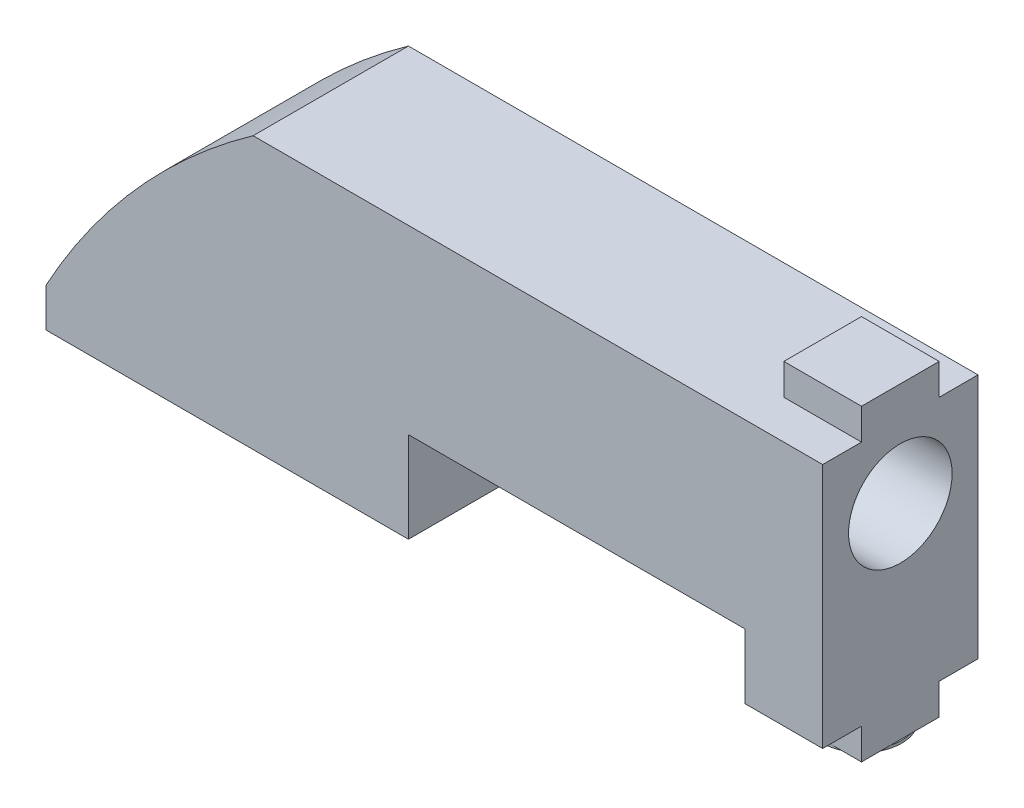
ISO-10303-21;
HEADER;
FILE_DESCRIPTION(('STEP AP214'),'2;1');
FILE_NAME('part.step','',(''),(''),'','','');
FILE_SCHEMA(('AUTOMOTIVE_DESIGN { 1 0 10303 214 1 1 1 1 }'));
ENDSEC;
DATA;
#1=APPLICATION_CONTEXT('core data for automotive mechanical design processes');
#2=APPLICATION_PROTOCOL_DEFINITION('international standard','automotive_design',2000,#1);
#3=PRODUCT_CONTEXT('',#1,'mechanical');
#4=PRODUCT('Part','Part','',(#3));
#5=PRODUCT_RELATED_PRODUCT_CATEGORY('part','',(#4));
#6=PRODUCT_DEFINITION_FORMATION('','',#4);
#7=PRODUCT_DEFINITION_CONTEXT('part definition',#1,'design');
#8=PRODUCT_DEFINITION('design','',#6,#7);
#9=PRODUCT_DEFINITION_SHAPE('','',#8);
#10=(LENGTH_UNIT() NAMED_UNIT(*) SI_UNIT(.MILLI.,.METRE.));
#11=(NAMED_UNIT(*) PLANE_ANGLE_UNIT() SI_UNIT($,.RADIAN.));
#12=(NAMED_UNIT(*) SI_UNIT($,.STERADIAN.) SOLID_ANGLE_UNIT());
#13=UNCERTAINTY_MEASURE_WITH_UNIT(LENGTH_MEASURE(1.E-05),#10,'distance_accuracy_value','');
#14=(GEOMETRIC_REPRESENTATION_CONTEXT(3) GLOBAL_UNCERTAINTY_ASSIGNED_CONTEXT((#13)) GLOBAL_UNIT_ASSIGNED_CONTEXT((#10,
#11,#12)) REPRESENTATION_CONTEXT('',''));
#15=CARTESIAN_POINT('',(0.,0.,0.));
#16=DIRECTION('',(0.,0.,1.));
#17=DIRECTION('',(1.,0.,0.));
#18=AXIS2_PLACEMENT_3D('',#15,#16,#17);
#19=CARTESIAN_POINT('',(30.,-0.199999999999999,-1.5));
#20=DIRECTION('',(0.,-1.,0.));
#21=DIRECTION('',(0.,0.,-1.));
#22=AXIS2_PLACEMENT_3D('',#19,#20,#21);
#23=PLANE('',#22);
#24=CARTESIAN_POINT('',(28.5256154225237,-0.199999999999999,0.));
#25=DIRECTION('',(0.,-1.,0.));
#26=DIRECTION('',(0.,0.,-1.));
#27=AXIS2_PLACEMENT_3D('',#24,#25,#26);
#28=CIRCLE('',#27,1.52561542252374);
#29=CARTESIAN_POINT('',(28.8040079824859,-0.199999999999999,-1.5));
#30=VERTEX_POINT('',#29);
#31=CARTESIAN_POINT('',(30.,-0.199999999999999,-0.392036395175811));
#32=VERTEX_POINT('',#31);
#33=EDGE_CURVE('E61',#30,#32,#28,.T.);
#34=ORIENTED_EDGE('',*,*,#33,.F.);
#35=DIRECTION('',(1.,0.,0.));
#36=VECTOR('',#35,1.);
#37=CARTESIAN_POINT('',(27.,-0.199999999999999,-1.5));
#38=LINE('',#37,#36);
#39=CARTESIAN_POINT('',(30.,-0.199999999999999,-1.5));
#40=VERTEX_POINT('',#39);
#41=EDGE_CURVE('E197',#30,#40,#38,.T.);
#42=ORIENTED_EDGE('',*,*,#41,.T.);
#43=DIRECTION('',(0.,0.,1.));
#44=VECTOR('',#43,1.);
#45=CARTESIAN_POINT('',(30.,-0.199999999999999,1.5));
#46=LINE('',#45,#44);
#47=EDGE_CURVE('E234',#40,#32,#46,.T.);
#48=ORIENTED_EDGE('',*,*,#47,.T.);
#49=EDGE_LOOP('',(#34,#42,#48));
#50=FACE_BOUND('',#49,.T.);
#51=ADVANCED_FACE('F43',(#50),#23,.T.);
#52=CARTESIAN_POINT('',(30.,-0.199999999999999,0.392036395175811));
#53=VERTEX_POINT('',#52);
#54=CARTESIAN_POINT('',(28.8040079824859,-0.199999999999999,1.5));
#55=VERTEX_POINT('',#54);
#56=EDGE_CURVE('E12',#53,#55,#28,.T.);
#57=ORIENTED_EDGE('',*,*,#56,.F.);
#58=CARTESIAN_POINT('',(30.,-0.199999999999999,1.5));
#59=VERTEX_POINT('',#58);
#60=EDGE_CURVE('E246',#53,#59,#46,.T.);
#61=ORIENTED_EDGE('',*,*,#60,.T.);
#62=DIRECTION('',(-1.,0.,0.));
#63=VECTOR('',#62,1.);
#64=CARTESIAN_POINT('',(27.,-0.199999999999999,1.5));
#65=LINE('',#64,#63);
#66=EDGE_CURVE('E231',#59,#55,#65,.T.);
#67=ORIENTED_EDGE('',*,*,#66,.T.);
#68=EDGE_LOOP('',(#57,#61,#67));
#69=FACE_BOUND('',#68,.T.);
#70=ADVANCED_FACE('F423',(#69),#23,.T.);
#71=CARTESIAN_POINT('',(28.2472228625616,-0.199999999999999,1.5));
#72=VERTEX_POINT('',#71);
#73=CARTESIAN_POINT('',(27.,-0.199999999999999,0.));
#74=VERTEX_POINT('',#73);
#75=EDGE_CURVE('E52',#72,#74,#28,.T.);
#76=ORIENTED_EDGE('',*,*,#75,.F.);
#77=CARTESIAN_POINT('',(27.,-0.199999999999999,1.5));
#78=VERTEX_POINT('',#77);
#79=EDGE_CURVE('E232',#72,#78,#65,.T.);
#80=ORIENTED_EDGE('',*,*,#79,.T.);
#81=DIRECTION('',(0.,0.,-1.));
#82=VECTOR('',#81,1.);
#83=CARTESIAN_POINT('',(27.,-0.199999999999999,1.5));
#84=LINE('',#83,#82);
#85=EDGE_CURVE('E238',#78,#74,#84,.T.);
#86=ORIENTED_EDGE('',*,*,#85,.T.);
#87=EDGE_LOOP('',(#76,#80,#86));
#88=FACE_BOUND('',#87,.T.);
#89=ADVANCED_FACE('F428',(#88),#23,.T.);
#90=CARTESIAN_POINT('',(27.,1.,3.));
#91=DIRECTION('',(0.,1.,0.));
#92=DIRECTION('',(0.,0.,1.));
#93=AXIS2_PLACEMENT_3D('',#90,#91,#92);
#94=PLANE('',#93);
#95=DIRECTION('',(-1.,0.,0.));
#96=VECTOR('',#95,1.);
#97=CARTESIAN_POINT('',(27.,1.,1.5));
#98=LINE('',#97,#96);
#99=CARTESIAN_POINT('',(30.,1.,1.5));
#100=VERTEX_POINT('',#99);
#101=CARTESIAN_POINT('',(27.,1.,1.5));
#102=VERTEX_POINT('',#101);
#103=EDGE_CURVE('E241',#100,#102,#98,.T.);
#104=ORIENTED_EDGE('',*,*,#103,.F.);
#105=DIRECTION('',(0.,0.,-1.));
#106=VECTOR('',#105,1.);
#107=CARTESIAN_POINT('',(30.,1.,3.));
#108=LINE('',#107,#106);
#109=CARTESIAN_POINT('',(30.,1.,3.));
#110=VERTEX_POINT('',#109);
#111=EDGE_CURVE('E350',#110,#100,#108,.T.);
#112=ORIENTED_EDGE('',*,*,#111,.F.);
#113=DIRECTION('',(1.,0.,0.));
#114=VECTOR('',#113,1.);
#115=CARTESIAN_POINT('',(27.,1.,3.));
#116=LINE('',#115,#114);
#117=CARTESIAN_POINT('',(27.,1.,3.));
#118=VERTEX_POINT('',#117);
#119=EDGE_CURVE('E308',#118,#110,#116,.T.);
#120=ORIENTED_EDGE('',*,*,#119,.F.);
#121=DIRECTION('',(0.,0.,-1.));
#122=VECTOR('',#121,1.);
#123=CARTESIAN_POINT('',(27.,1.,3.));
#124=LINE('',#123,#122);
#125=EDGE_CURVE('E363',#118,#102,#124,.T.);
#126=ORIENTED_EDGE('',*,*,#125,.T.);
#127=EDGE_LOOP('',(#104,#112,#120,#126));
#128=FACE_BOUND('',#127,.T.);
#129=ADVANCED_FACE('F442',(#128),#94,.F.);
#130=DIRECTION('',(1.,0.,0.));
#131=VECTOR('',#130,1.);
#132=CARTESIAN_POINT('',(27.,1.,-1.5));
#133=LINE('',#132,#131);
#134=CARTESIAN_POINT('',(27.,1.,-1.5));
#135=VERTEX_POINT('',#134);
#136=CARTESIAN_POINT('',(30.,1.,-1.5));
#137=VERTEX_POINT('',#136);
#138=EDGE_CURVE('E243',#135,#137,#133,.T.);
#139=ORIENTED_EDGE('',*,*,#138,.F.);
#140=CARTESIAN_POINT('',(27.,1.,-3.));
#141=VERTEX_POINT('',#140);
#142=EDGE_CURVE('E365',#135,#141,#124,.T.);
#143=ORIENTED_EDGE('',*,*,#142,.T.);
#144=DIRECTION('',(1.,0.,0.));
#145=VECTOR('',#144,1.);
#146=CARTESIAN_POINT('',(27.,1.,-3.));
#147=LINE('',#146,#145);
#148=CARTESIAN_POINT('',(30.,1.,-3.));
#149=VERTEX_POINT('',#148);
#150=EDGE_CURVE('E328',#141,#149,#147,.T.);
#151=ORIENTED_EDGE('',*,*,#150,.T.);
#152=EDGE_CURVE('E357',#137,#149,#108,.T.);
#153=ORIENTED_EDGE('',*,*,#152,.F.);
#154=EDGE_LOOP('',(#139,#143,#151,#153));
#155=FACE_BOUND('',#154,.T.);
#156=ADVANCED_FACE('F384',(#155),#94,.F.);
#157=CARTESIAN_POINT('',(8.,10.5,3.));
#158=DIRECTION('',(0.,-1.,0.));
#159=DIRECTION('',(0.,0.,-1.));
#160=AXIS2_PLACEMENT_3D('',#157,#158,#159);
#161=PLANE('',#160);
#162=DIRECTION('',(1.,0.,0.));
#163=VECTOR('',#162,1.);
#164=CARTESIAN_POINT('',(30.,10.5,1.5));
#165=LINE('',#164,#163);
#166=CARTESIAN_POINT('',(27.,10.5,1.5));
#167=VERTEX_POINT('',#166);
#168=CARTESIAN_POINT('',(30.,10.5,1.5));
#169=VERTEX_POINT('',#168);
#170=EDGE_CURVE('E260',#167,#169,#165,.T.);
#171=ORIENTED_EDGE('',*,*,#170,.F.);
#172=DIRECTION('',(0.,0.,1.));
#173=VECTOR('',#172,1.);
#174=CARTESIAN_POINT('',(27.,10.5,-1.5));
#175=LINE('',#174,#173);
#176=CARTESIAN_POINT('',(27.,10.5,-1.5));
#177=VERTEX_POINT('',#176);
#178=EDGE_CURVE('E267',#177,#167,#175,.T.);
#179=ORIENTED_EDGE('',*,*,#178,.F.);
#180=DIRECTION('',(-1.,0.,0.));
#181=VECTOR('',#180,1.);
#182=CARTESIAN_POINT('',(30.,10.5,-1.5));
#183=LINE('',#182,#181);
#184=CARTESIAN_POINT('',(30.,10.5,-1.5));
#185=VERTEX_POINT('',#184);
#186=EDGE_CURVE('E255',#185,#177,#183,.T.);
#187=ORIENTED_EDGE('',*,*,#186,.F.);
#188=DIRECTION('',(0.,0.,-1.));
#189=VECTOR('',#188,1.);
#190=CARTESIAN_POINT('',(30.,10.5,3.));
#191=LINE('',#190,#189);
#192=CARTESIAN_POINT('',(30.,10.5,-3.));
#193=VERTEX_POINT('',#192);
#194=EDGE_CURVE('E347',#185,#193,#191,.T.);
#195=ORIENTED_EDGE('',*,*,#194,.T.);
#196=DIRECTION('',(-1.,0.,0.));
#197=VECTOR('',#196,1.);
#198=CARTESIAN_POINT('',(8.,10.5,-3.));
#199=LINE('',#198,#197);
#200=CARTESIAN_POINT('',(8.,10.5,-3.));
#201=VERTEX_POINT('',#200);
#202=EDGE_CURVE('E334',#193,#201,#199,.T.);
#203=ORIENTED_EDGE('',*,*,#202,.T.);
#204=DIRECTION('',(0.,0.,-1.));
#205=VECTOR('',#204,1.);
#206=CARTESIAN_POINT('',(8.,10.5,3.));
#207=LINE('',#206,#205);
#208=CARTESIAN_POINT('',(8.,10.5,3.));
#209=VERTEX_POINT('',#208);
#210=EDGE_CURVE('E344',#209,#201,#207,.T.);
#211=ORIENTED_EDGE('',*,*,#210,.F.);
#212=DIRECTION('',(-1.,0.,0.));
#213=VECTOR('',#212,1.);
#214=CARTESIAN_POINT('',(8.,10.5,3.));
#215=LINE('',#214,#213);
#216=CARTESIAN_POINT('',(30.,10.5,3.));
#217=VERTEX_POINT('',#216);
#218=EDGE_CURVE('E312',#217,#209,#215,.T.);
#219=ORIENTED_EDGE('',*,*,#218,.F.);
#220=EDGE_CURVE('E356',#217,#169,#191,.T.);
#221=ORIENTED_EDGE('',*,*,#220,.T.);
#222=EDGE_LOOP('',(#171,#179,#187,#195,#203,#211,#219,#221));
#223=FACE_BOUND('',#222,.T.);
#224=ADVANCED_FACE('F393',(#223),#161,.F.);
#225=CARTESIAN_POINT('',(14.,0.,3.));
#226=DIRECTION('',(0.,1.,0.));
#227=DIRECTION('',(-1.,0.,0.));
#228=AXIS2_PLACEMENT_3D('',#225,#226,#227);
#229=PLANE('',#228);
#230=DIRECTION('',(1.,0.,0.));
#231=VECTOR('',#230,1.);
#232=CARTESIAN_POINT('',(14.,0.,-3.));
#233=LINE('',#232,#231);
#234=CARTESIAN_POINT('',(0.,0.,-3.));
#235=VERTEX_POINT('',#234);
#236=CARTESIAN_POINT('',(14.,0.,-3.));
#237=VERTEX_POINT('',#236);
#238=EDGE_CURVE('E295',#235,#237,#233,.T.);
#239=ORIENTED_EDGE('',*,*,#238,.T.);
#240=DIRECTION('',(0.,0.,-1.));
#241=VECTOR('',#240,1.);
#242=CARTESIAN_POINT('',(14.,0.,3.));
#243=LINE('',#242,#241);
#244=CARTESIAN_POINT('',(14.,0.,3.));
#245=VERTEX_POINT('',#244);
#246=EDGE_CURVE('E212',#245,#237,#243,.T.);
#247=ORIENTED_EDGE('',*,*,#246,.F.);
#248=DIRECTION('',(1.,0.,0.));
#249=VECTOR('',#248,1.);
#250=CARTESIAN_POINT('',(14.,0.,3.));
#251=LINE('',#250,#249);
#252=CARTESIAN_POINT('',(0.,0.,3.));
#253=VERTEX_POINT('',#252);
#254=EDGE_CURVE('E297',#253,#245,#251,.T.);
#255=ORIENTED_EDGE('',*,*,#254,.F.);
#256=DIRECTION('',(0.,0.,-1.));
#257=VECTOR('',#256,1.);
#258=CARTESIAN_POINT('',(0.,0.,3.));
#259=LINE('',#258,#257);
#260=EDGE_CURVE('E318',#253,#235,#259,.T.);
#261=ORIENTED_EDGE('',*,*,#260,.T.);
#262=EDGE_LOOP('',(#239,#247,#255,#261));
#263=FACE_BOUND('',#262,.T.);
#264=ADVANCED_FACE('F45',(#263),#229,.F.);
#265=CARTESIAN_POINT('',(14.,3.5,3.));
#266=DIRECTION('',(-1.,0.,0.));
#267=DIRECTION('',(0.,-1.,0.));
#268=AXIS2_PLACEMENT_3D('',#265,#266,#267);
#269=PLANE('',#268);
#270=DIRECTION('',(0.,1.,0.));
#271=VECTOR('',#270,1.);
#272=CARTESIAN_POINT('',(14.,3.5,-3.));
#273=LINE('',#272,#271);
#274=CARTESIAN_POINT('',(14.,3.5,-3.));
#275=VERTEX_POINT('',#274);
#276=EDGE_CURVE('E321',#237,#275,#273,.T.);
#277=ORIENTED_EDGE('',*,*,#276,.T.);
#278=DIRECTION('',(0.,0.,-1.));
#279=VECTOR('',#278,1.);
#280=CARTESIAN_POINT('',(14.,3.5,3.));
#281=LINE('',#280,#279);
#282=CARTESIAN_POINT('',(14.,3.5,3.));
#283=VERTEX_POINT('',#282);
#284=EDGE_CURVE('E214',#283,#275,#281,.T.);
#285=ORIENTED_EDGE('',*,*,#284,.F.);
#286=DIRECTION('',(0.,1.,0.));
#287=VECTOR('',#286,1.);
#288=CARTESIAN_POINT('',(14.,3.5,3.));
#289=LINE('',#288,#287);
#290=EDGE_CURVE('E301',#245,#283,#289,.T.);
#291=ORIENTED_EDGE('',*,*,#290,.F.);
#292=ORIENTED_EDGE('',*,*,#246,.T.);
#293=EDGE_LOOP('',(#277,#285,#291,#292));
#294=FACE_BOUND('',#293,.T.);
#295=ADVANCED_FACE('F463',(#294),#269,.F.);
#296=CARTESIAN_POINT('',(27.,3.5,3.));
#297=DIRECTION('',(0.,1.,0.));
#298=DIRECTION('',(-1.,0.,0.));
#299=AXIS2_PLACEMENT_3D('',#296,#297,#298);
#300=PLANE('',#299);
#301=DIRECTION('',(1.,0.,0.));
#302=VECTOR('',#301,1.);
#303=CARTESIAN_POINT('',(27.,3.5,-3.));
#304=LINE('',#303,#302);
#305=CARTESIAN_POINT('',(27.,3.5,-3.));
#306=VERTEX_POINT('',#305);
#307=EDGE_CURVE('E323',#275,#306,#304,.T.);
#308=ORIENTED_EDGE('',*,*,#307,.T.);
#309=DIRECTION('',(0.,0.,-1.));
#310=VECTOR('',#309,1.);
#311=CARTESIAN_POINT('',(27.,3.5,3.));
#312=LINE('',#311,#310);
#313=CARTESIAN_POINT('',(27.,3.5,3.));
#314=VERTEX_POINT('',#313);
#315=EDGE_CURVE('E361',#314,#306,#312,.T.);
#316=ORIENTED_EDGE('',*,*,#315,.F.);
#317=DIRECTION('',(1.,0.,0.));
#318=VECTOR('',#317,1.);
#319=CARTESIAN_POINT('',(27.,3.5,3.));
#320=LINE('',#319,#318);
#321=EDGE_CURVE('E304',#283,#314,#320,.T.);
#322=ORIENTED_EDGE('',*,*,#321,.F.);
#323=ORIENTED_EDGE('',*,*,#284,.T.);
#324=EDGE_LOOP('',(#308,#316,#322,#323));
#325=FACE_BOUND('',#324,.T.);
#326=ADVANCED_FACE('F460',(#325),#300,.F.);
#327=CARTESIAN_POINT('',(27.,1.,3.));
#328=DIRECTION('',(1.,0.,0.));
#329=DIRECTION('',(0.,1.,0.));
#330=AXIS2_PLACEMENT_3D('',#327,#328,#329);
#331=PLANE('',#330);
#332=DIRECTION('',(0.,-1.,0.));
#333=VECTOR('',#332,1.);
#334=CARTESIAN_POINT('',(27.,1.,-3.));
#335=LINE('',#334,#333);
#336=EDGE_CURVE('E325',#306,#141,#335,.T.);
#337=ORIENTED_EDGE('',*,*,#336,.T.);
#338=ORIENTED_EDGE('',*,*,#142,.F.);
#339=DIRECTION('',(0.,1.,0.));
#340=VECTOR('',#339,1.);
#341=CARTESIAN_POINT('',(27.,-0.199999999999999,-1.5));
#342=LINE('',#341,#340);
#343=CARTESIAN_POINT('',(27.,-0.199999999999999,-1.5));
#344=VERTEX_POINT('',#343);
#345=EDGE_CURVE('E248',#344,#135,#342,.T.);
#346=ORIENTED_EDGE('',*,*,#345,.F.);
#347=EDGE_CURVE('E191',#74,#344,#84,.T.);
#348=ORIENTED_EDGE('',*,*,#347,.F.);
#349=ORIENTED_EDGE('',*,*,#85,.F.);
#350=DIRECTION('',(0.,1.,0.));
#351=VECTOR('',#350,1.);
#352=CARTESIAN_POINT('',(27.,-0.199999999999999,1.5));
#353=LINE('',#352,#351);
#354=EDGE_CURVE('E250',#78,#102,#353,.T.);
#355=ORIENTED_EDGE('',*,*,#354,.T.);
#356=ORIENTED_EDGE('',*,*,#125,.F.);
#357=DIRECTION('',(0.,-1.,0.));
#358=VECTOR('',#357,1.);
#359=CARTESIAN_POINT('',(27.,1.,3.));
#360=LINE('',#359,#358);
#361=EDGE_CURVE('E306',#314,#118,#360,.T.);
#362=ORIENTED_EDGE('',*,*,#361,.F.);
#363=ORIENTED_EDGE('',*,*,#315,.T.);
#364=EDGE_LOOP('',(#337,#338,#346,#348,#349,#355,#356,#362,#363));
#365=FACE_BOUND('',#364,.T.);
#366=ADVANCED_FACE('F451',(#365),#331,.F.);
#367=CARTESIAN_POINT('',(30.,10.5,3.));
#368=DIRECTION('',(-1.,0.,0.));
#369=DIRECTION('',(0.,-1.,0.));
#370=AXIS2_PLACEMENT_3D('',#367,#368,#369);
#371=PLANE('',#370);
#372=CARTESIAN_POINT('',(30.,7.7,0.));
#373=DIRECTION('',(1.,0.,0.));
#374=DIRECTION('',(0.,0.,-1.));
#375=AXIS2_PLACEMENT_3D('',#372,#373,#374);
#376=CIRCLE('',#375,2.);
#377=CARTESIAN_POINT('',(30.,7.7,-2.));
#378=VERTEX_POINT('',#377);
#379=EDGE_CURVE('E244',#378,#378,#376,.T.);
#380=ORIENTED_EDGE('',*,*,#379,.F.);
#381=EDGE_LOOP('',(#380));
#382=FACE_BOUND('',#381,.T.);
#383=DIRECTION('',(0.,1.,0.));
#384=VECTOR('',#383,1.);
#385=CARTESIAN_POINT('',(30.,10.5,-3.));
#386=LINE('',#385,#384);
#387=EDGE_CURVE('E331',#149,#193,#386,.T.);
#388=ORIENTED_EDGE('',*,*,#387,.T.);
#389=ORIENTED_EDGE('',*,*,#194,.F.);
#390=DIRECTION('',(0.,-1.,0.));
#391=VECTOR('',#390,1.);
#392=CARTESIAN_POINT('',(30.,11.7,-1.5));
#393=LINE('',#392,#391);
#394=CARTESIAN_POINT('',(30.,11.7,-1.5));
#395=VERTEX_POINT('',#394);
#396=EDGE_CURVE('E290',#395,#185,#393,.T.);
#397=ORIENTED_EDGE('',*,*,#396,.F.);
#398=DIRECTION('',(0.,0.,-1.));
#399=VECTOR('',#398,1.);
#400=CARTESIAN_POINT('',(30.,11.7,-1.5));
#401=LINE('',#400,#399);
#402=CARTESIAN_POINT('',(30.,11.7,1.5));
#403=VERTEX_POINT('',#402);
#404=EDGE_CURVE('E256',#403,#395,#401,.T.);
#405=ORIENTED_EDGE('',*,*,#404,.F.);
#406=DIRECTION('',(0.,-1.,0.));
#407=VECTOR('',#406,1.);
#408=CARTESIAN_POINT('',(30.,11.7,1.5));
#409=LINE('',#408,#407);
#410=EDGE_CURVE('E266',#403,#169,#409,.T.);
#411=ORIENTED_EDGE('',*,*,#410,.T.);
#412=ORIENTED_EDGE('',*,*,#220,.F.);
#413=DIRECTION('',(0.,1.,0.));
#414=VECTOR('',#413,1.);
#415=CARTESIAN_POINT('',(30.,10.5,3.));
#416=LINE('',#415,#414);
#417=EDGE_CURVE('E310',#110,#217,#416,.T.);
#418=ORIENTED_EDGE('',*,*,#417,.F.);
#419=ORIENTED_EDGE('',*,*,#111,.T.);
#420=DIRECTION('',(0.,1.,0.));
#421=VECTOR('',#420,1.);
#422=CARTESIAN_POINT('',(30.,-0.199999999999999,1.5));
#423=LINE('',#422,#421);
#424=EDGE_CURVE('E253',#59,#100,#423,.T.);
#425=ORIENTED_EDGE('',*,*,#424,.F.);
#426=ORIENTED_EDGE('',*,*,#60,.F.);
#427=EDGE_CURVE('E454',#32,#53,#46,.T.);
#428=ORIENTED_EDGE('',*,*,#427,.F.);
#429=ORIENTED_EDGE('',*,*,#47,.F.);
#430=DIRECTION('',(0.,1.,0.));
#431=VECTOR('',#430,1.);
#432=CARTESIAN_POINT('',(30.,-0.199999999999999,-1.5));
#433=LINE('',#432,#431);
#434=EDGE_CURVE('E194',#40,#137,#433,.T.);
#435=ORIENTED_EDGE('',*,*,#434,.T.);
#436=ORIENTED_EDGE('',*,*,#152,.T.);
#437=EDGE_LOOP('',(#388,#389,#397,#405,#411,#412,#418,#419,#425,#426,#428,#429,#435,#436));
#438=FACE_BOUND('',#437,.T.);
#439=ADVANCED_FACE('F378',(#382,#438),#371,.F.);
#440=CARTESIAN_POINT('',(23.3665507302786,-11.2147117602476,3.));
#441=DIRECTION('',(0.,0.,-1.));
#442=DIRECTION('',(-1.,0.,0.));
#443=AXIS2_PLACEMENT_3D('',#440,#441,#442);
#444=CYLINDRICAL_SURFACE('',#443,26.6018718923474);
#445=CARTESIAN_POINT('',(23.3665507302786,-11.2147117602476,-3.));
#446=DIRECTION('',(0.,0.,1.));
#447=DIRECTION('',(1.,0.,0.));
#448=AXIS2_PLACEMENT_3D('',#445,#446,#447);
#449=CIRCLE('',#448,26.6018718923474);
#450=CARTESIAN_POINT('',(0.,1.5,-3.));
#451=VERTEX_POINT('',#450);
#452=EDGE_CURVE('E336',#201,#451,#449,.T.);
#453=ORIENTED_EDGE('',*,*,#452,.T.);
#454=DIRECTION('',(0.,0.,-1.));
#455=VECTOR('',#454,1.);
#456=CARTESIAN_POINT('',(0.,1.5,3.));
#457=LINE('',#456,#455);
#458=CARTESIAN_POINT('',(0.,1.5,3.));
#459=VERTEX_POINT('',#458);
#460=EDGE_CURVE('E341',#459,#451,#457,.T.);
#461=ORIENTED_EDGE('',*,*,#460,.F.);
#462=CARTESIAN_POINT('',(23.3665507302786,-11.2147117602476,3.));
#463=DIRECTION('',(0.,0.,1.));
#464=DIRECTION('',(1.,0.,0.));
#465=AXIS2_PLACEMENT_3D('',#462,#463,#464);
#466=CIRCLE('',#465,26.6018718923474);
#467=EDGE_CURVE('E314',#209,#459,#466,.T.);
#468=ORIENTED_EDGE('',*,*,#467,.F.);
#469=ORIENTED_EDGE('',*,*,#210,.T.);
#470=EDGE_LOOP('',(#453,#461,#468,#469));
#471=FACE_BOUND('',#470,.T.);
#472=ADVANCED_FACE('F397',(#471),#444,.T.);
#473=CARTESIAN_POINT('',(0.,0.,3.));
#474=DIRECTION('',(1.,0.,0.));
#475=DIRECTION('',(0.,0.,-1.));
#476=AXIS2_PLACEMENT_3D('',#473,#474,#475);
#477=PLANE('',#476);
#478=DIRECTION('',(0.,-1.,0.));
#479=VECTOR('',#478,1.);
#480=CARTESIAN_POINT('',(0.,0.,-3.));
#481=LINE('',#480,#479);
#482=EDGE_CURVE('E302',#451,#235,#481,.T.);
#483=ORIENTED_EDGE('',*,*,#482,.T.);
#484=ORIENTED_EDGE('',*,*,#260,.F.);
#485=DIRECTION('',(0.,-1.,0.));
#486=VECTOR('',#485,1.);
#487=CARTESIAN_POINT('',(0.,0.,3.));
#488=LINE('',#487,#486);
#489=EDGE_CURVE('E316',#459,#253,#488,.T.);
#490=ORIENTED_EDGE('',*,*,#489,.F.);
#491=ORIENTED_EDGE('',*,*,#460,.T.);
#492=EDGE_LOOP('',(#483,#484,#490,#491));
#493=FACE_BOUND('',#492,.T.);
#494=ADVANCED_FACE('F468',(#493),#477,.F.);
#495=CARTESIAN_POINT('',(23.3665507302786,-11.2147117602476,3.));
#496=DIRECTION('',(0.,0.,1.));
#497=DIRECTION('',(1.,0.,0.));
#498=AXIS2_PLACEMENT_3D('',#495,#496,#497);
#499=PLANE('',#498);
#500=ORIENTED_EDGE('',*,*,#254,.T.);
#501=ORIENTED_EDGE('',*,*,#290,.T.);
#502=ORIENTED_EDGE('',*,*,#321,.T.);
#503=ORIENTED_EDGE('',*,*,#361,.T.);
#504=ORIENTED_EDGE('',*,*,#119,.T.);
#505=ORIENTED_EDGE('',*,*,#417,.T.);
#506=ORIENTED_EDGE('',*,*,#218,.T.);
#507=ORIENTED_EDGE('',*,*,#467,.T.);
#508=ORIENTED_EDGE('',*,*,#489,.T.);
#509=EDGE_LOOP('',(#500,#501,#502,#503,#504,#505,#506,#507,#508));
#510=FACE_BOUND('',#509,.T.);
#511=ADVANCED_FACE('F401',(#510),#499,.T.);
#512=CARTESIAN_POINT('',(23.3665507302786,-11.2147117602476,-3.));
#513=DIRECTION('',(0.,0.,1.));
#514=DIRECTION('',(1.,0.,0.));
#515=AXIS2_PLACEMENT_3D('',#512,#513,#514);
#516=PLANE('',#515);
#517=ORIENTED_EDGE('',*,*,#238,.F.);
#518=ORIENTED_EDGE('',*,*,#482,.F.);
#519=ORIENTED_EDGE('',*,*,#452,.F.);
#520=ORIENTED_EDGE('',*,*,#202,.F.);
#521=ORIENTED_EDGE('',*,*,#387,.F.);
#522=ORIENTED_EDGE('',*,*,#150,.F.);
#523=ORIENTED_EDGE('',*,*,#336,.F.);
#524=ORIENTED_EDGE('',*,*,#307,.F.);
#525=ORIENTED_EDGE('',*,*,#276,.F.);
#526=EDGE_LOOP('',(#517,#518,#519,#520,#521,#522,#523,#524,#525));
#527=FACE_BOUND('',#526,.T.);
#528=ADVANCED_FACE('F388',(#527),#516,.F.);
#529=CARTESIAN_POINT('',(30.,11.7,-1.5));
#530=DIRECTION('',(0.,0.,1.));
#531=DIRECTION('',(1.,0.,0.));
#532=AXIS2_PLACEMENT_3D('',#529,#530,#531);
#533=PLANE('',#532);
#534=ORIENTED_EDGE('',*,*,#186,.T.);
#535=DIRECTION('',(0.,-1.,0.));
#536=VECTOR('',#535,1.);
#537=CARTESIAN_POINT('',(27.,11.7,-1.5));
#538=LINE('',#537,#536);
#539=CARTESIAN_POINT('',(27.,11.7,-1.5));
#540=VERTEX_POINT('',#539);
#541=EDGE_CURVE('E285',#540,#177,#538,.T.);
#542=ORIENTED_EDGE('',*,*,#541,.F.);
#543=DIRECTION('',(-1.,0.,0.));
#544=VECTOR('',#543,1.);
#545=CARTESIAN_POINT('',(30.,11.7,-1.5));
#546=LINE('',#545,#544);
#547=EDGE_CURVE('E259',#395,#540,#546,.T.);
#548=ORIENTED_EDGE('',*,*,#547,.F.);
#549=ORIENTED_EDGE('',*,*,#396,.T.);
#550=EDGE_LOOP('',(#534,#542,#548,#549));
#551=FACE_BOUND('',#550,.T.);
#552=ADVANCED_FACE('F410',(#551),#533,.F.);
#553=CARTESIAN_POINT('',(27.,11.7,-1.5));
#554=DIRECTION('',(1.,0.,0.));
#555=DIRECTION('',(0.,0.,-1.));
#556=AXIS2_PLACEMENT_3D('',#553,#554,#555);
#557=PLANE('',#556);
#558=ORIENTED_EDGE('',*,*,#178,.T.);
#559=DIRECTION('',(0.,-1.,0.));
#560=VECTOR('',#559,1.);
#561=CARTESIAN_POINT('',(27.,11.7,1.5));
#562=LINE('',#561,#560);
#563=CARTESIAN_POINT('',(27.,11.7,1.5));
#564=VERTEX_POINT('',#563);
#565=EDGE_CURVE('E272',#564,#167,#562,.T.);
#566=ORIENTED_EDGE('',*,*,#565,.F.);
#567=DIRECTION('',(0.,0.,1.));
#568=VECTOR('',#567,1.);
#569=CARTESIAN_POINT('',(27.,11.7,-1.5));
#570=LINE('',#569,#568);
#571=EDGE_CURVE('E262',#540,#564,#570,.T.);
#572=ORIENTED_EDGE('',*,*,#571,.F.);
#573=ORIENTED_EDGE('',*,*,#541,.T.);
#574=EDGE_LOOP('',(#558,#566,#572,#573));
#575=FACE_BOUND('',#574,.T.);
#576=ADVANCED_FACE('F407',(#575),#557,.F.);
#577=CARTESIAN_POINT('',(30.,11.7,1.5));
#578=DIRECTION('',(0.,0.,-1.));
#579=DIRECTION('',(-1.,0.,0.));
#580=AXIS2_PLACEMENT_3D('',#577,#578,#579);
#581=PLANE('',#580);
#582=ORIENTED_EDGE('',*,*,#170,.T.);
#583=ORIENTED_EDGE('',*,*,#410,.F.);
#584=DIRECTION('',(1.,0.,0.));
#585=VECTOR('',#584,1.);
#586=CARTESIAN_POINT('',(30.,11.7,1.5));
#587=LINE('',#586,#585);
#588=EDGE_CURVE('E264',#564,#403,#587,.T.);
#589=ORIENTED_EDGE('',*,*,#588,.F.);
#590=ORIENTED_EDGE('',*,*,#565,.T.);
#591=EDGE_LOOP('',(#582,#583,#589,#590));
#592=FACE_BOUND('',#591,.T.);
#593=ADVANCED_FACE('F403',(#592),#581,.F.);
#594=CARTESIAN_POINT('',(30.,11.7,1.5));
#595=DIRECTION('',(0.,-1.,0.));
#596=DIRECTION('',(0.,0.,-1.));
#597=AXIS2_PLACEMENT_3D('',#594,#595,#596);
#598=PLANE('',#597);
#599=ORIENTED_EDGE('',*,*,#404,.T.);
#600=ORIENTED_EDGE('',*,*,#547,.T.);
#601=ORIENTED_EDGE('',*,*,#571,.T.);
#602=ORIENTED_EDGE('',*,*,#588,.T.);
#603=EDGE_LOOP('',(#599,#600,#601,#602));
#604=FACE_BOUND('',#603,.T.);
#605=ADVANCED_FACE('F406',(#604),#598,.F.);
#606=CARTESIAN_POINT('',(27.,-0.199999999999999,1.5));
#607=DIRECTION('',(0.,0.,-1.));
#608=DIRECTION('',(-1.,0.,0.));
#609=AXIS2_PLACEMENT_3D('',#606,#607,#608);
#610=PLANE('',#609);
#611=ORIENTED_EDGE('',*,*,#103,.T.);
#612=ORIENTED_EDGE('',*,*,#354,.F.);
#613=ORIENTED_EDGE('',*,*,#79,.F.);
#614=EDGE_CURVE('E226',#55,#72,#65,.T.);
#615=ORIENTED_EDGE('',*,*,#614,.F.);
#616=ORIENTED_EDGE('',*,*,#66,.F.);
#617=ORIENTED_EDGE('',*,*,#424,.T.);
#618=EDGE_LOOP('',(#611,#612,#613,#615,#616,#617));
#619=FACE_BOUND('',#618,.T.);
#620=ADVANCED_FACE('F440',(#619),#610,.F.);
#621=CARTESIAN_POINT('',(27.,-0.199999999999999,-1.5));
#622=DIRECTION('',(0.,0.,1.));
#623=DIRECTION('',(1.,0.,0.));
#624=AXIS2_PLACEMENT_3D('',#621,#622,#623);
#625=PLANE('',#624);
#626=ORIENTED_EDGE('',*,*,#138,.T.);
#627=ORIENTED_EDGE('',*,*,#434,.F.);
#628=ORIENTED_EDGE('',*,*,#41,.F.);
#629=CARTESIAN_POINT('',(28.2472228625616,-0.199999999999999,-1.5));
#630=VERTEX_POINT('',#629);
#631=EDGE_CURVE('E195',#630,#30,#38,.T.);
#632=ORIENTED_EDGE('',*,*,#631,.F.);
#633=EDGE_CURVE('E188',#344,#630,#38,.T.);
#634=ORIENTED_EDGE('',*,*,#633,.F.);
#635=ORIENTED_EDGE('',*,*,#345,.T.);
#636=EDGE_LOOP('',(#626,#627,#628,#632,#634,#635));
#637=FACE_BOUND('',#636,.T.);
#638=ADVANCED_FACE('F201',(#637),#625,.F.);
#639=EDGE_CURVE('E69',#74,#630,#28,.T.);
#640=ORIENTED_EDGE('',*,*,#639,.F.);
#641=ORIENTED_EDGE('',*,*,#347,.T.);
#642=ORIENTED_EDGE('',*,*,#633,.T.);
#643=EDGE_LOOP('',(#640,#641,#642));
#644=FACE_BOUND('',#643,.T.);
#645=ADVANCED_FACE('F190',(#644),#23,.T.);
#646=CARTESIAN_POINT('',(30.,7.7,0.));
#647=DIRECTION('',(1.,0.,0.));
#648=DIRECTION('',(0.,0.,-1.));
#649=AXIS2_PLACEMENT_3D('',#646,#647,#648);
#650=CYLINDRICAL_SURFACE('',#649,2.);
#651=CARTESIAN_POINT('',(27.,7.7,0.));
#652=DIRECTION('',(1.,0.,0.));
#653=DIRECTION('',(0.,0.,-1.));
#654=AXIS2_PLACEMENT_3D('',#651,#652,#653);
#655=CIRCLE('',#654,2.);
#656=CARTESIAN_POINT('',(27.,7.7,-2.));
#657=VERTEX_POINT('',#656);
#658=EDGE_CURVE('E220',#657,#657,#655,.T.);
#659=ORIENTED_EDGE('',*,*,#658,.F.);
#660=EDGE_LOOP('',(#659));
#661=FACE_BOUND('',#660,.T.);
#662=ORIENTED_EDGE('',*,*,#379,.T.);
#663=EDGE_LOOP('',(#662));
#664=FACE_BOUND('',#663,.T.);
#665=ADVANCED_FACE('F433',(#661,#664),#650,.F.);
#666=CARTESIAN_POINT('',(27.,7.7,0.));
#667=DIRECTION('',(1.,0.,0.));
#668=DIRECTION('',(0.,0.,-1.));
#669=AXIS2_PLACEMENT_3D('',#666,#667,#668);
#670=CONICAL_SURFACE('',#669,2.,1.02974425867665);
#671=CARTESIAN_POINT('',(25.7982787619449,7.7,0.));
#672=VERTEX_POINT('',#671);
#673=VERTEX_LOOP('',#672);
#674=FACE_BOUND('',#673,.T.);
#675=ORIENTED_EDGE('',*,*,#658,.T.);
#676=EDGE_LOOP('',(#675));
#677=FACE_BOUND('',#676,.T.);
#678=ADVANCED_FACE('F438',(#674,#677),#670,.F.);
#679=CARTESIAN_POINT('',(28.5256154225237,-0.199999999999999,0.));
#680=DIRECTION('',(0.,-1.,0.));
#681=DIRECTION('',(0.,0.,-1.));
#682=AXIS2_PLACEMENT_3D('',#679,#680,#681);
#683=PLANE('',#682);
#684=EDGE_CURVE('E54',#32,#53,#28,.T.);
#685=ORIENTED_EDGE('',*,*,#684,.F.);
#686=ORIENTED_EDGE('',*,*,#427,.T.);
#687=EDGE_LOOP('',(#685,#686));
#688=FACE_BOUND('',#687,.T.);
#689=ADVANCED_FACE('F606',(#688),#683,.F.);
#690=EDGE_CURVE('E208',#55,#72,#28,.T.);
#691=ORIENTED_EDGE('',*,*,#690,.F.);
#692=ORIENTED_EDGE('',*,*,#614,.T.);
#693=EDGE_LOOP('',(#691,#692));
#694=FACE_BOUND('',#693,.T.);
#695=ADVANCED_FACE('F225',(#694),#683,.F.);
#696=EDGE_CURVE('E205',#630,#30,#28,.T.);
#697=ORIENTED_EDGE('',*,*,#696,.F.);
#698=ORIENTED_EDGE('',*,*,#631,.T.);
#699=EDGE_LOOP('',(#697,#698));
#700=FACE_BOUND('',#699,.T.);
#701=ADVANCED_FACE('F206',(#700),#683,.F.);
#702=CARTESIAN_POINT('',(28.5256154225237,-0.299999999999999,0.));
#703=DIRECTION('',(0.,1.,0.));
#704=DIRECTION('',(0.,0.,1.));
#705=AXIS2_PLACEMENT_3D('',#702,#703,#704);
#706=CYLINDRICAL_SURFACE('',#705,1.52561542252374);
#707=CARTESIAN_POINT('',(28.5256154225237,-0.299999999999999,0.));
#708=DIRECTION('',(0.,-1.,0.));
#709=DIRECTION('',(0.,0.,-1.));
#710=AXIS2_PLACEMENT_3D('',#707,#708,#709);
#711=CIRCLE('',#710,1.52561542252374);
#712=CARTESIAN_POINT('',(28.5256154225237,-0.299999999999999,-1.52561542252374));
#713=VERTEX_POINT('',#712);
#714=EDGE_CURVE('E217',#713,#713,#711,.T.);
#715=ORIENTED_EDGE('',*,*,#714,.F.);
#716=EDGE_LOOP('',(#715));
#717=FACE_BOUND('',#716,.T.);
#718=ORIENTED_EDGE('',*,*,#33,.T.);
#719=ORIENTED_EDGE('',*,*,#684,.T.);
#720=ORIENTED_EDGE('',*,*,#56,.T.);
#721=ORIENTED_EDGE('',*,*,#690,.T.);
#722=ORIENTED_EDGE('',*,*,#75,.T.);
#723=ORIENTED_EDGE('',*,*,#639,.T.);
#724=ORIENTED_EDGE('',*,*,#696,.T.);
#725=EDGE_LOOP('',(#718,#719,#720,#721,#722,#723,#724));
#726=FACE_BOUND('',#725,.T.);
#727=ADVANCED_FACE('F210',(#717,#726),#706,.T.);
#728=CARTESIAN_POINT('',(28.5256154225237,-0.299999999999999,0.));
#729=DIRECTION('',(0.,-1.,0.));
#730=DIRECTION('',(0.,0.,-1.));
#731=AXIS2_PLACEMENT_3D('',#728,#729,#730);
#732=PLANE('',#731);
#733=ORIENTED_EDGE('',*,*,#714,.T.);
#734=EDGE_LOOP('',(#733));
#735=FACE_BOUND('',#734,.T.);
#736=ADVANCED_FACE('F636',(#735),#732,.T.);
#737=CLOSED_SHELL('',(#51,#70,#89,#129,#156,#224,#264,#295,#326,#366,#439,#472,#494,#511,#528,
#552,#576,#593,#605,#620,#638,#645,#665,#678,#689,#695,#701,#727,#736));
#738=MANIFOLD_SOLID_BREP('B2',#737);
#739=ADVANCED_BREP_SHAPE_REPRESENTATION('',(#18,#738),#14);
#740=SHAPE_DEFINITION_REPRESENTATION(#9,#739);
ENDSEC;
END-ISO-10303-21;
